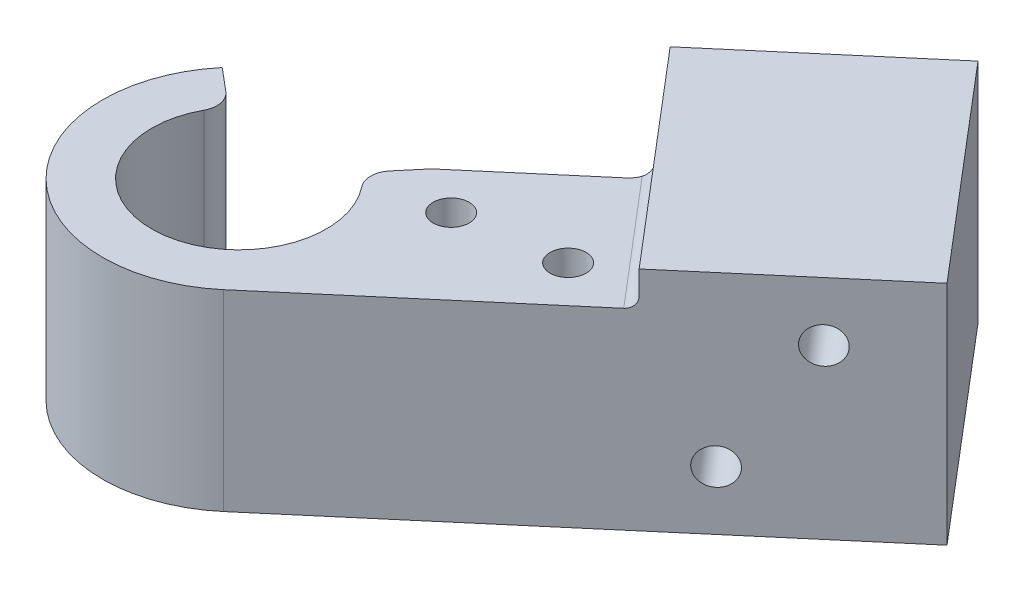
ISO-10303-21;
HEADER;
FILE_DESCRIPTION(('STEP AP214'),'2;1');
FILE_NAME('part.step','',(''),(''),'','','');
FILE_SCHEMA(('AUTOMOTIVE_DESIGN { 1 0 10303 214 1 1 1 1 }'));
ENDSEC;
DATA;
#1=APPLICATION_CONTEXT('core data for automotive mechanical design processes');
#2=APPLICATION_PROTOCOL_DEFINITION('international standard','automotive_design',2000,#1);
#3=PRODUCT_CONTEXT('',#1,'mechanical');
#4=PRODUCT('Part','Part','',(#3));
#5=PRODUCT_RELATED_PRODUCT_CATEGORY('part','',(#4));
#6=PRODUCT_DEFINITION_FORMATION('','',#4);
#7=PRODUCT_DEFINITION_CONTEXT('part definition',#1,'design');
#8=PRODUCT_DEFINITION('design','',#6,#7);
#9=PRODUCT_DEFINITION_SHAPE('','',#8);
#10=(LENGTH_UNIT() NAMED_UNIT(*) SI_UNIT(.MILLI.,.METRE.));
#11=(NAMED_UNIT(*) PLANE_ANGLE_UNIT() SI_UNIT($,.RADIAN.));
#12=(NAMED_UNIT(*) SI_UNIT($,.STERADIAN.) SOLID_ANGLE_UNIT());
#13=UNCERTAINTY_MEASURE_WITH_UNIT(LENGTH_MEASURE(1.E-05),#10,'distance_accuracy_value','');
#14=(GEOMETRIC_REPRESENTATION_CONTEXT(3) GLOBAL_UNCERTAINTY_ASSIGNED_CONTEXT((#13)) GLOBAL_UNIT_ASSIGNED_CONTEXT((#10,
#11,#12)) REPRESENTATION_CONTEXT('',''));
#15=CARTESIAN_POINT('',(0.,0.,0.));
#16=DIRECTION('',(0.,0.,1.));
#17=DIRECTION('',(1.,0.,0.));
#18=AXIS2_PLACEMENT_3D('',#15,#16,#17);
#19=CARTESIAN_POINT('',(0.,17.6,0.));
#20=DIRECTION('',(0.,-1.,0.));
#21=DIRECTION('',(0.,0.,-1.));
#22=AXIS2_PLACEMENT_3D('',#19,#20,#21);
#23=CYLINDRICAL_SURFACE('',#22,12.5);
#24=DIRECTION('',(0.,1.,0.));
#25=VECTOR('',#24,1.);
#26=CARTESIAN_POINT('',(8.10037181798933,0.,9.52018783482365));
#27=LINE('',#26,#25);
#28=CARTESIAN_POINT('',(8.10037181798933,0.,9.52018783482365));
#29=VERTEX_POINT('',#28);
#30=CARTESIAN_POINT('',(8.10037181798933,17.6,9.52018783482365));
#31=VERTEX_POINT('',#30);
#32=EDGE_CURVE('E298',#29,#31,#27,.T.);
#33=ORIENTED_EDGE('',*,*,#32,.T.);
#34=CARTESIAN_POINT('',(0.,17.6,0.));
#35=DIRECTION('',(0.,1.,0.));
#36=DIRECTION('',(0.,0.,1.));
#37=AXIS2_PLACEMENT_3D('',#34,#35,#36);
#38=CIRCLE('',#37,12.5);
#39=CARTESIAN_POINT('',(-9.57555553898724,17.6,-8.03484512108172));
#40=VERTEX_POINT('',#39);
#41=EDGE_CURVE('E341',#40,#31,#38,.T.);
#42=ORIENTED_EDGE('',*,*,#41,.F.);
#43=DIRECTION('',(0.,1.,0.));
#44=VECTOR('',#43,1.);
#45=CARTESIAN_POINT('',(-9.57555553898724,0.,-8.03484512108172));
#46=LINE('',#45,#44);
#47=CARTESIAN_POINT('',(-9.57555553898724,0.,-8.03484512108172));
#48=VERTEX_POINT('',#47);
#49=EDGE_CURVE('E324',#48,#40,#46,.T.);
#50=ORIENTED_EDGE('',*,*,#49,.F.);
#51=CARTESIAN_POINT('',(0.,0.,0.));
#52=DIRECTION('',(0.,1.,0.));
#53=DIRECTION('',(0.,0.,1.));
#54=AXIS2_PLACEMENT_3D('',#51,#52,#53);
#55=CIRCLE('',#54,12.5);
#56=EDGE_CURVE('E346',#48,#29,#55,.T.);
#57=ORIENTED_EDGE('',*,*,#56,.T.);
#58=EDGE_LOOP('',(#33,#42,#50,#57));
#59=FACE_BOUND('',#58,.T.);
#60=ADVANCED_FACE('F49',(#59),#23,.T.);
#61=CARTESIAN_POINT('',(0.,17.6,0.));
#62=DIRECTION('',(0.,1.,0.));
#63=DIRECTION('',(0.,0.,1.));
#64=AXIS2_PLACEMENT_3D('',#61,#62,#63);
#65=PLANE('',#64);
#66=CARTESIAN_POINT('',(21.7498736910186,17.6,-8.3869134163618));
#67=DIRECTION('',(0.,1.,0.));
#68=DIRECTION('',(0.,0.,1.));
#69=AXIS2_PLACEMENT_3D('',#66,#67,#68);
#70=CIRCLE('',#69,1.64999999999999);
#71=CARTESIAN_POINT('',(21.7498736910186,17.6,-6.73691341636181));
#72=VERTEX_POINT('',#71);
#73=EDGE_CURVE('E205',#72,#72,#70,.T.);
#74=ORIENTED_EDGE('',*,*,#73,.F.);
#75=EDGE_LOOP('',(#74));
#76=FACE_BOUND('',#75,.T.);
#77=CARTESIAN_POINT('',(12.4168047495357,17.6,-7.01075058677808));
#78=DIRECTION('',(0.,1.,0.));
#79=DIRECTION('',(0.,0.,1.));
#80=AXIS2_PLACEMENT_3D('',#77,#78,#79);
#81=CIRCLE('',#80,1.64999999999999);
#82=CARTESIAN_POINT('',(12.4168047495357,17.6,-5.36075058677809));
#83=VERTEX_POINT('',#82);
#84=EDGE_CURVE('E204',#83,#83,#81,.T.);
#85=ORIENTED_EDGE('',*,*,#84,.F.);
#86=EDGE_LOOP('',(#85));
#87=FACE_BOUND('',#86,.T.);
#88=DIRECTION('',(0.761615026785892,0.,-0.648029745439146));
#89=VECTOR('',#88,1.);
#90=CARTESIAN_POINT('',(8.10037181798933,17.6,9.52018783482365));
#91=LINE('',#90,#89);
#92=CARTESIAN_POINT('',(27.9023625144225,17.6,-7.32858554659416));
#93=VERTEX_POINT('',#92);
#94=EDGE_CURVE('E290',#31,#93,#91,.T.);
#95=ORIENTED_EDGE('',*,*,#94,.T.);
#96=DIRECTION('',(-0.648029745439146,0.,-0.761615026785892));
#97=VECTOR('',#96,1.);
#98=CARTESIAN_POINT('',(18.4501563547061,17.6,-18.4375543835721));
#99=LINE('',#98,#97);
#100=CARTESIAN_POINT('',(18.2765173077443,17.6,-18.6416285149428));
#101=VERTEX_POINT('',#100);
#102=EDGE_CURVE('E66',#93,#101,#99,.T.);
#103=ORIENTED_EDGE('',*,*,#102,.T.);
#104=CARTESIAN_POINT('',(16.3924818370419,17.6,-19.3127546917047));
#105=DIRECTION('',(0.,1.,0.));
#106=DIRECTION('',(0.,0.,1.));
#107=AXIS2_PLACEMENT_3D('',#104,#105,#106);
#108=CIRCLE('',#107,2.);
#109=CARTESIAN_POINT('',(17.6885413279202,17.6,-17.7895246381329));
#110=VERTEX_POINT('',#109);
#111=EDGE_CURVE('E59',#101,#110,#108,.F.);
#112=ORIENTED_EDGE('',*,*,#111,.T.);
#113=DIRECTION('',(-0.761615026785892,0.,0.648029745439146));
#114=VECTOR('',#113,1.);
#115=CARTESIAN_POINT('',(-1.35183434172712,17.6,-1.58878100215428));
#116=LINE('',#115,#114);
#117=CARTESIAN_POINT('',(8.03484512108176,17.6,-9.57555553898721));
#118=VERTEX_POINT('',#117);
#119=EDGE_CURVE('E295',#110,#118,#116,.T.);
#120=ORIENTED_EDGE('',*,*,#119,.T.);
#121=DIRECTION('',(0.642787609686541,0.,-0.766044443118977));
#122=VECTOR('',#121,1.);
#123=CARTESIAN_POINT('',(0.,17.6,0.));
#124=LINE('',#123,#122);
#125=CARTESIAN_POINT('',(6.29800662686119,17.6,-7.50567202374394));
#126=VERTEX_POINT('',#125);
#127=EDGE_CURVE('E310',#126,#118,#124,.T.);
#128=ORIENTED_EDGE('',*,*,#127,.F.);
#129=CARTESIAN_POINT('',(7.83009551309915,17.6,-6.22009680437086));
#130=DIRECTION('',(0.,1.,0.));
#131=DIRECTION('',(0.,0.,1.));
#132=AXIS2_PLACEMENT_3D('',#129,#130,#131);
#133=CIRCLE('',#132,2.);
#134=CARTESIAN_POINT('',(6.26407641047932,17.6,-4.97607744349669));
#135=VERTEX_POINT('',#134);
#136=EDGE_CURVE('E370',#126,#135,#133,.T.);
#137=ORIENTED_EDGE('',*,*,#136,.T.);
#138=CARTESIAN_POINT('',(0.,17.6,0.));
#139=DIRECTION('',(0.,1.,0.));
#140=DIRECTION('',(0.,0.,1.));
#141=AXIS2_PLACEMENT_3D('',#138,#139,#140);
#142=CIRCLE('',#141,8.);
#143=CARTESIAN_POINT('',(-7.03299779449363,17.6,-3.81273419249857));
#144=VERTEX_POINT('',#143);
#145=EDGE_CURVE('E328',#144,#135,#142,.T.);
#146=ORIENTED_EDGE('',*,*,#145,.F.);
#147=CARTESIAN_POINT('',(-8.79124724311704,17.6,-4.76591774062321));
#148=DIRECTION('',(0.,1.,0.));
#149=DIRECTION('',(0.,0.,1.));
#150=AXIS2_PLACEMENT_3D('',#147,#148,#149);
#151=CIRCLE('',#150,2.);
#152=CARTESIAN_POINT('',(-7.50567202374397,17.6,-6.29800662686116));
#153=VERTEX_POINT('',#152);
#154=EDGE_CURVE('E373',#144,#153,#151,.T.);
#155=ORIENTED_EDGE('',*,*,#154,.T.);
#156=DIRECTION('',(-0.766044443118979,0.,-0.642787609686538));
#157=VECTOR('',#156,1.);
#158=CARTESIAN_POINT('',(0.,17.6,0.));
#159=LINE('',#158,#157);
#160=EDGE_CURVE('E305',#153,#40,#159,.T.);
#161=ORIENTED_EDGE('',*,*,#160,.T.);
#162=ORIENTED_EDGE('',*,*,#41,.T.);
#163=EDGE_LOOP('',(#95,#103,#112,#120,#128,#137,#146,#155,#161,#162));
#164=FACE_BOUND('',#163,.T.);
#165=ADVANCED_FACE('F456',(#76,#87,#164),#65,.T.);
#166=CARTESIAN_POINT('',(0.,-22.6274169979695,0.));
#167=DIRECTION('',(0.,1.,0.));
#168=DIRECTION('',(0.,0.,1.));
#169=AXIS2_PLACEMENT_3D('',#166,#167,#168);
#170=CYLINDRICAL_SURFACE('',#169,8.);
#171=CARTESIAN_POINT('',(0.,2.,0.));
#172=DIRECTION('',(0.,1.,0.));
#173=DIRECTION('',(0.,0.,1.));
#174=AXIS2_PLACEMENT_3D('',#171,#172,#173);
#175=CIRCLE('',#174,8.);
#176=CARTESIAN_POINT('',(6.26407641047932,2.,-4.97607744349669));
#177=VERTEX_POINT('',#176);
#178=CARTESIAN_POINT('',(-7.03299779449363,2.,-3.81273419249857));
#179=VERTEX_POINT('',#178);
#180=EDGE_CURVE('E335',#177,#179,#175,.F.);
#181=ORIENTED_EDGE('',*,*,#180,.T.);
#182=DIRECTION('',(0.,1.,0.));
#183=VECTOR('',#182,1.);
#184=CARTESIAN_POINT('',(-7.03299779449363,-22.6274169979695,-3.81273419249856));
#185=LINE('',#184,#183);
#186=EDGE_CURVE('E367',#179,#144,#185,.T.);
#187=ORIENTED_EDGE('',*,*,#186,.T.);
#188=ORIENTED_EDGE('',*,*,#145,.T.);
#189=DIRECTION('',(0.,1.,0.));
#190=VECTOR('',#189,1.);
#191=CARTESIAN_POINT('',(6.26407641047932,-22.6274169979695,-4.97607744349669));
#192=LINE('',#191,#190);
#193=EDGE_CURVE('E363',#135,#177,#192,.F.);
#194=ORIENTED_EDGE('',*,*,#193,.T.);
#195=EDGE_LOOP('',(#181,#187,#188,#194));
#196=FACE_BOUND('',#195,.T.);
#197=ADVANCED_FACE('F462',(#196),#170,.F.);
#198=CARTESIAN_POINT('',(0.,-33.2,0.));
#199=DIRECTION('',(0.,1.,0.));
#200=DIRECTION('',(0.,0.,1.));
#201=AXIS2_PLACEMENT_3D('',#198,#199,#200);
#202=CYLINDRICAL_SURFACE('',#201,6.875);
#203=CARTESIAN_POINT('',(0.,0.,0.));
#204=DIRECTION('',(0.,1.,0.));
#205=DIRECTION('',(0.,0.,1.));
#206=AXIS2_PLACEMENT_3D('',#203,#204,#205);
#207=CIRCLE('',#206,6.875);
#208=CARTESIAN_POINT('',(0.,0.,6.875));
#209=VERTEX_POINT('',#208);
#210=EDGE_CURVE('E349',#209,#209,#207,.T.);
#211=ORIENTED_EDGE('',*,*,#210,.F.);
#212=EDGE_LOOP('',(#211));
#213=FACE_BOUND('',#212,.T.);
#214=CARTESIAN_POINT('',(0.,2.,0.));
#215=DIRECTION('',(0.,1.,0.));
#216=DIRECTION('',(0.,0.,1.));
#217=AXIS2_PLACEMENT_3D('',#214,#215,#216);
#218=CIRCLE('',#217,6.875);
#219=CARTESIAN_POINT('',(0.,2.,6.875));
#220=VERTEX_POINT('',#219);
#221=EDGE_CURVE('E340',#220,#220,#218,.F.);
#222=ORIENTED_EDGE('',*,*,#221,.F.);
#223=EDGE_LOOP('',(#222));
#224=FACE_BOUND('',#223,.T.);
#225=ADVANCED_FACE('F636',(#213,#224),#202,.F.);
#226=CARTESIAN_POINT('',(0.,0.,0.));
#227=DIRECTION('',(0.,1.,0.));
#228=DIRECTION('',(0.,0.,1.));
#229=AXIS2_PLACEMENT_3D('',#226,#227,#228);
#230=PLANE('',#229);
#231=DIRECTION('',(-0.766044443118979,0.,-0.642787609686538));
#232=VECTOR('',#231,1.);
#233=CARTESIAN_POINT('',(0.,0.,0.));
#234=LINE('',#233,#232);
#235=CARTESIAN_POINT('',(-6.85170979440004,0.,-5.7492671614148));
#236=VERTEX_POINT('',#235);
#237=EDGE_CURVE('E306',#236,#48,#234,.T.);
#238=ORIENTED_EDGE('',*,*,#237,.F.);
#239=CARTESIAN_POINT('',(-6.2089221847135,0.,-6.51531160453378));
#240=DIRECTION('',(0.,1.,0.));
#241=DIRECTION('',(0.,0.,1.));
#242=AXIS2_PLACEMENT_3D('',#239,#240,#241);
#243=CIRCLE('',#242,1.);
#244=CARTESIAN_POINT('',(-5.51904194196755,0.,-5.79138809291892));
#245=VERTEX_POINT('',#244);
#246=EDGE_CURVE('E414',#236,#245,#243,.T.);
#247=ORIENTED_EDGE('',*,*,#246,.T.);
#248=CARTESIAN_POINT('',(0.,0.,0.));
#249=DIRECTION('',(0.,1.,0.));
#250=DIRECTION('',(0.,0.,1.));
#251=AXIS2_PLACEMENT_3D('',#248,#249,#250);
#252=CIRCLE('',#251,8.);
#253=CARTESIAN_POINT('',(4.42953130515187,0.,-6.66177547029916));
#254=VERTEX_POINT('',#253);
#255=EDGE_CURVE('E309',#245,#254,#252,.F.);
#256=ORIENTED_EDGE('',*,*,#255,.T.);
#257=CARTESIAN_POINT('',(4.98322271829585,0.,-7.49449740408656));
#258=DIRECTION('',(0.,1.,0.));
#259=DIRECTION('',(0.,0.,1.));
#260=AXIS2_PLACEMENT_3D('',#257,#258,#259);
#261=CIRCLE('',#260,1.);
#262=CARTESIAN_POINT('',(5.74926716141483,0.,-6.85170979440002));
#263=VERTEX_POINT('',#262);
#264=EDGE_CURVE('E420',#254,#263,#261,.T.);
#265=ORIENTED_EDGE('',*,*,#264,.T.);
#266=DIRECTION('',(0.642787609686541,0.,-0.766044443118977));
#267=VECTOR('',#266,1.);
#268=CARTESIAN_POINT('',(0.,0.,0.));
#269=LINE('',#268,#267);
#270=CARTESIAN_POINT('',(8.03484512108176,0.,-9.57555553898721));
#271=VERTEX_POINT('',#270);
#272=EDGE_CURVE('E314',#263,#271,#269,.T.);
#273=ORIENTED_EDGE('',*,*,#272,.T.);
#274=DIRECTION('',(-0.761615026785892,0.,0.648029745439146));
#275=VECTOR('',#274,1.);
#276=CARTESIAN_POINT('',(-1.35183434172712,0.,-1.58878100215428));
#277=LINE('',#276,#275);
#278=CARTESIAN_POINT('',(17.6885413279202,0.,-17.7895246381329));
#279=VERTEX_POINT('',#278);
#280=EDGE_CURVE('E294',#279,#271,#277,.T.);
#281=ORIENTED_EDGE('',*,*,#280,.F.);
#282=CARTESIAN_POINT('',(16.3924818370419,0.,-19.3127546917047));
#283=DIRECTION('',(0.,1.,0.));
#284=DIRECTION('',(0.,0.,1.));
#285=AXIS2_PLACEMENT_3D('',#282,#283,#284);
#286=CIRCLE('',#285,2.);
#287=CARTESIAN_POINT('',(17.9157118906137,0.,-20.608814182583));
#288=VERTEX_POINT('',#287);
#289=EDGE_CURVE('E12',#279,#288,#286,.T.);
#290=ORIENTED_EDGE('',*,*,#289,.T.);
#291=DIRECTION('',(-0.648029745439146,0.,-0.761615026785892));
#292=VECTOR('',#291,1.);
#293=CARTESIAN_POINT('',(28.6639775412084,0.,-7.9766152920333));
#294=LINE('',#293,#292);
#295=CARTESIAN_POINT('',(12.4632339052298,0.,-27.0169909616806));
#296=VERTEX_POINT('',#295);
#297=EDGE_CURVE('E271',#288,#296,#294,.T.);
#298=ORIENTED_EDGE('',*,*,#297,.T.);
#299=DIRECTION('',(-0.761615026785892,0.,0.648029745439146));
#300=VECTOR('',#299,1.);
#301=CARTESIAN_POINT('',(27.6955344409476,0.,-39.9775858704635));
#302=LINE('',#301,#300);
#303=CARTESIAN_POINT('',(27.6955344409476,0.,-39.9775858704635));
#304=VERTEX_POINT('',#303);
#305=EDGE_CURVE('E286',#304,#296,#302,.T.);
#306=ORIENTED_EDGE('',*,*,#305,.F.);
#307=DIRECTION('',(-0.648029745439146,0.,-0.761615026785892));
#308=VECTOR('',#307,1.);
#309=CARTESIAN_POINT('',(43.8962780769263,0.,-20.9372102008162));
#310=LINE('',#309,#308);
#311=CARTESIAN_POINT('',(43.8962780769263,0.,-20.9372102008162));
#312=VERTEX_POINT('',#311);
#313=EDGE_CURVE('E257',#312,#304,#310,.T.);
#314=ORIENTED_EDGE('',*,*,#313,.F.);
#315=DIRECTION('',(0.761615026785892,0.,-0.648029745439146));
#316=VECTOR('',#315,1.);
#317=CARTESIAN_POINT('',(8.10037181798933,0.,9.52018783482365));
#318=LINE('',#317,#316);
#319=EDGE_CURVE('E291',#29,#312,#318,.T.);
#320=ORIENTED_EDGE('',*,*,#319,.F.);
#321=ORIENTED_EDGE('',*,*,#56,.F.);
#322=EDGE_LOOP('',(#238,#247,#256,#265,#273,#281,#290,#298,#306,#314,#320,#321));
#323=FACE_BOUND('',#322,.T.);
#324=ORIENTED_EDGE('',*,*,#210,.T.);
#325=EDGE_LOOP('',(#324));
#326=FACE_BOUND('',#325,.T.);
#327=ADVANCED_FACE('F466',(#323,#326),#230,.F.);
#328=CARTESIAN_POINT('',(0.,2.,0.));
#329=DIRECTION('',(0.,1.,0.));
#330=DIRECTION('',(0.,0.,1.));
#331=AXIS2_PLACEMENT_3D('',#328,#329,#330);
#332=PLANE('',#331);
#333=CARTESIAN_POINT('',(-5.51904194196755,2.,-5.79138809291892));
#334=VERTEX_POINT('',#333);
#335=CARTESIAN_POINT('',(4.42953130515187,2.,-6.66177547029916));
#336=VERTEX_POINT('',#335);
#337=EDGE_CURVE('E336',#334,#336,#175,.F.);
#338=ORIENTED_EDGE('',*,*,#337,.F.);
#339=CARTESIAN_POINT('',(-6.2089221847135,2.,-6.51531160453378));
#340=DIRECTION('',(0.,1.,0.));
#341=DIRECTION('',(0.,0.,1.));
#342=AXIS2_PLACEMENT_3D('',#339,#340,#341);
#343=CIRCLE('',#342,1.);
#344=CARTESIAN_POINT('',(-6.85170979440004,2.,-5.7492671614148));
#345=VERTEX_POINT('',#344);
#346=EDGE_CURVE('E411',#334,#345,#343,.F.);
#347=ORIENTED_EDGE('',*,*,#346,.T.);
#348=DIRECTION('',(0.766044443118979,0.,0.642787609686538));
#349=VECTOR('',#348,1.);
#350=CARTESIAN_POINT('',(0.,2.,0.));
#351=LINE('',#350,#349);
#352=CARTESIAN_POINT('',(-7.50567202374396,2.,-6.29800662686116));
#353=VERTEX_POINT('',#352);
#354=EDGE_CURVE('E345',#353,#345,#351,.T.);
#355=ORIENTED_EDGE('',*,*,#354,.F.);
#356=CARTESIAN_POINT('',(-8.79124724311704,2.,-4.76591774062321));
#357=DIRECTION('',(0.,1.,0.));
#358=DIRECTION('',(0.,0.,1.));
#359=AXIS2_PLACEMENT_3D('',#356,#357,#358);
#360=CIRCLE('',#359,2.);
#361=EDGE_CURVE('E382',#353,#179,#360,.F.);
#362=ORIENTED_EDGE('',*,*,#361,.T.);
#363=ORIENTED_EDGE('',*,*,#180,.F.);
#364=CARTESIAN_POINT('',(7.83009551309915,2.,-6.22009680437086));
#365=DIRECTION('',(0.,1.,0.));
#366=DIRECTION('',(0.,0.,1.));
#367=AXIS2_PLACEMENT_3D('',#364,#365,#366);
#368=CIRCLE('',#367,2.);
#369=CARTESIAN_POINT('',(6.29800662686119,2.,-7.50567202374394));
#370=VERTEX_POINT('',#369);
#371=EDGE_CURVE('E385',#177,#370,#368,.F.);
#372=ORIENTED_EDGE('',*,*,#371,.T.);
#373=DIRECTION('',(0.642787609686541,0.,-0.766044443118977));
#374=VECTOR('',#373,1.);
#375=CARTESIAN_POINT('',(0.,2.,0.));
#376=LINE('',#375,#374);
#377=CARTESIAN_POINT('',(5.74926716141483,2.,-6.85170979440002));
#378=VERTEX_POINT('',#377);
#379=EDGE_CURVE('E379',#378,#370,#376,.T.);
#380=ORIENTED_EDGE('',*,*,#379,.F.);
#381=CARTESIAN_POINT('',(4.98322271829585,2.,-7.49449740408656));
#382=DIRECTION('',(0.,1.,0.));
#383=DIRECTION('',(0.,0.,1.));
#384=AXIS2_PLACEMENT_3D('',#381,#382,#383);
#385=CIRCLE('',#384,1.);
#386=EDGE_CURVE('E417',#378,#336,#385,.F.);
#387=ORIENTED_EDGE('',*,*,#386,.T.);
#388=EDGE_LOOP('',(#338,#347,#355,#362,#363,#372,#380,#387));
#389=FACE_BOUND('',#388,.T.);
#390=ORIENTED_EDGE('',*,*,#221,.T.);
#391=EDGE_LOOP('',(#390));
#392=FACE_BOUND('',#391,.T.);
#393=ADVANCED_FACE('F574',(#389,#392),#332,.T.);
#394=CARTESIAN_POINT('',(0.,0.,0.));
#395=DIRECTION('',(0.642787609686538,0.,-0.766044443118979));
#396=DIRECTION('',(-0.766044443118979,0.,-0.642787609686538));
#397=AXIS2_PLACEMENT_3D('',#394,#395,#396);
#398=PLANE('',#397);
#399=ORIENTED_EDGE('',*,*,#354,.T.);
#400=DIRECTION('',(0.,1.,0.));
#401=VECTOR('',#400,1.);
#402=CARTESIAN_POINT('',(-6.85170979440004,0.,-5.7492671614148));
#403=LINE('',#402,#401);
#404=EDGE_CURVE('E404',#345,#236,#403,.F.);
#405=ORIENTED_EDGE('',*,*,#404,.T.);
#406=ORIENTED_EDGE('',*,*,#237,.T.);
#407=ORIENTED_EDGE('',*,*,#49,.T.);
#408=ORIENTED_EDGE('',*,*,#160,.F.);
#409=DIRECTION('',(0.,-1.,0.));
#410=VECTOR('',#409,1.);
#411=CARTESIAN_POINT('',(-7.50567202374396,1.99999999999999,-6.29800662686116));
#412=LINE('',#411,#410);
#413=EDGE_CURVE('E359',#153,#353,#412,.T.);
#414=ORIENTED_EDGE('',*,*,#413,.T.);
#415=EDGE_LOOP('',(#399,#405,#406,#407,#408,#414));
#416=FACE_BOUND('',#415,.T.);
#417=ADVANCED_FACE('F485',(#416),#398,.T.);
#418=CARTESIAN_POINT('',(0.,0.,0.));
#419=DIRECTION('',(0.766044443118977,0.,0.642787609686541));
#420=DIRECTION('',(0.642787609686541,0.,-0.766044443118977));
#421=AXIS2_PLACEMENT_3D('',#418,#419,#420);
#422=PLANE('',#421);
#423=ORIENTED_EDGE('',*,*,#272,.F.);
#424=DIRECTION('',(0.,-1.,0.));
#425=VECTOR('',#424,1.);
#426=CARTESIAN_POINT('',(5.74926716141483,2.,-6.85170979440002));
#427=LINE('',#426,#425);
#428=EDGE_CURVE('E407',#263,#378,#427,.F.);
#429=ORIENTED_EDGE('',*,*,#428,.T.);
#430=ORIENTED_EDGE('',*,*,#379,.T.);
#431=DIRECTION('',(0.,1.,0.));
#432=VECTOR('',#431,1.);
#433=CARTESIAN_POINT('',(6.29800662686119,0.,-7.50567202374394));
#434=LINE('',#433,#432);
#435=EDGE_CURVE('E376',#370,#126,#434,.T.);
#436=ORIENTED_EDGE('',*,*,#435,.T.);
#437=ORIENTED_EDGE('',*,*,#127,.T.);
#438=DIRECTION('',(0.,1.,0.));
#439=VECTOR('',#438,1.);
#440=CARTESIAN_POINT('',(8.03484512108176,0.,-9.57555553898721));
#441=LINE('',#440,#439);
#442=EDGE_CURVE('E318',#271,#118,#441,.T.);
#443=ORIENTED_EDGE('',*,*,#442,.F.);
#444=EDGE_LOOP('',(#423,#429,#430,#436,#437,#443));
#445=FACE_BOUND('',#444,.T.);
#446=ADVANCED_FACE('F592',(#445),#422,.F.);
#447=CARTESIAN_POINT('',(0.,0.,0.));
#448=DIRECTION('',(0.,1.,0.));
#449=DIRECTION('',(0.,0.,1.));
#450=AXIS2_PLACEMENT_3D('',#447,#448,#449);
#451=CYLINDRICAL_SURFACE('',#450,8.);
#452=ORIENTED_EDGE('',*,*,#255,.F.);
#453=DIRECTION('',(0.,1.,0.));
#454=VECTOR('',#453,1.);
#455=CARTESIAN_POINT('',(-5.51904194196755,0.,-5.79138809291892));
#456=LINE('',#455,#454);
#457=EDGE_CURVE('E400',#245,#334,#456,.T.);
#458=ORIENTED_EDGE('',*,*,#457,.T.);
#459=ORIENTED_EDGE('',*,*,#337,.T.);
#460=DIRECTION('',(0.,1.,0.));
#461=VECTOR('',#460,1.);
#462=CARTESIAN_POINT('',(4.42953130515187,0.,-6.66177547029916));
#463=LINE('',#462,#461);
#464=EDGE_CURVE('E397',#336,#254,#463,.F.);
#465=ORIENTED_EDGE('',*,*,#464,.T.);
#466=EDGE_LOOP('',(#452,#458,#459,#465));
#467=FACE_BOUND('',#466,.T.);
#468=ADVANCED_FACE('F586',(#467),#451,.T.);
#469=CARTESIAN_POINT('',(8.10037181798933,0.,9.52018783482365));
#470=DIRECTION('',(0.648029745439146,0.,0.761615026785892));
#471=DIRECTION('',(0.761615026785892,0.,-0.648029745439146));
#472=AXIS2_PLACEMENT_3D('',#469,#470,#471);
#473=PLANE('',#472);
#474=CARTESIAN_POINT('',(37.8033578626391,15.3875,-15.7529722373031));
#475=DIRECTION('',(0.648029745439147,0.,0.761615026785892));
#476=DIRECTION('',(0.761615026785892,0.,-0.648029745439147));
#477=AXIS2_PLACEMENT_3D('',#474,#475,#476);
#478=CIRCLE('',#477,1.64999999999999);
#479=CARTESIAN_POINT('',(39.0600226568358,15.3875,-16.8222213172777));
#480=VERTEX_POINT('',#479);
#481=EDGE_CURVE('E220',#480,#480,#478,.T.);
#482=ORIENTED_EDGE('',*,*,#481,.F.);
#483=EDGE_LOOP('',(#482));
#484=FACE_BOUND('',#483,.T.);
#485=CARTESIAN_POINT('',(32.4720526751379,5.3875,-11.216764019229));
#486=DIRECTION('',(0.648029745439147,0.,0.761615026785892));
#487=DIRECTION('',(0.761615026785892,0.,-0.648029745439147));
#488=AXIS2_PLACEMENT_3D('',#485,#486,#487);
#489=CIRCLE('',#488,1.64999999999999);
#490=CARTESIAN_POINT('',(33.7287174693346,5.3875,-12.2860130992036));
#491=VERTEX_POINT('',#490);
#492=EDGE_CURVE('E228',#491,#491,#489,.T.);
#493=ORIENTED_EDGE('',*,*,#492,.F.);
#494=EDGE_LOOP('',(#493));
#495=FACE_BOUND('',#494,.T.);
#496=ORIENTED_EDGE('',*,*,#94,.F.);
#497=ORIENTED_EDGE('',*,*,#32,.F.);
#498=ORIENTED_EDGE('',*,*,#319,.T.);
#499=DIRECTION('',(0.,-1.,0.));
#500=VECTOR('',#499,1.);
#501=CARTESIAN_POINT('',(43.8962780769263,0.,-20.9372102008162));
#502=LINE('',#501,#500);
#503=CARTESIAN_POINT('',(43.8962780769263,20.775,-20.9372102008162));
#504=VERTEX_POINT('',#503);
#505=EDGE_CURVE('E253',#504,#312,#502,.T.);
#506=ORIENTED_EDGE('',*,*,#505,.F.);
#507=DIRECTION('',(-0.761615026785892,0.,0.648029745439146));
#508=VECTOR('',#507,1.);
#509=CARTESIAN_POINT('',(43.8962780769263,20.775,-20.9372102008162));
#510=LINE('',#509,#508);
#511=CARTESIAN_POINT('',(28.6639775412084,20.775,-7.9766152920333));
#512=VERTEX_POINT('',#511);
#513=EDGE_CURVE('E267',#504,#512,#510,.T.);
#514=ORIENTED_EDGE('',*,*,#513,.T.);
#515=DIRECTION('',(0.,-1.,0.));
#516=VECTOR('',#515,1.);
#517=CARTESIAN_POINT('',(28.6639775412084,0.,-7.9766152920333));
#518=LINE('',#517,#516);
#519=CARTESIAN_POINT('',(28.6639775412084,18.6,-7.9766152920333));
#520=VERTEX_POINT('',#519);
#521=EDGE_CURVE('E252',#512,#520,#518,.T.);
#522=ORIENTED_EDGE('',*,*,#521,.T.);
#523=CARTESIAN_POINT('',(27.9023625144225,18.6,-7.32858554659416));
#524=DIRECTION('',(0.648029745439146,0.,0.761615026785892));
#525=DIRECTION('',(0.761615026785892,0.,-0.648029745439146));
#526=AXIS2_PLACEMENT_3D('',#523,#524,#525);
#527=CIRCLE('',#526,1.);
#528=EDGE_CURVE('E394',#520,#93,#527,.F.);
#529=ORIENTED_EDGE('',*,*,#528,.T.);
#530=EDGE_LOOP('',(#496,#497,#498,#506,#514,#522,#529));
#531=FACE_BOUND('',#530,.T.);
#532=ADVANCED_FACE('F477',(#484,#495,#531),#473,.T.);
#533=CARTESIAN_POINT('',(-1.35183434172712,0.,-1.58878100215428));
#534=DIRECTION('',(-0.648029745439146,0.,-0.761615026785892));
#535=DIRECTION('',(-0.761615026785892,0.,0.648029745439146));
#536=AXIS2_PLACEMENT_3D('',#533,#534,#535);
#537=PLANE('',#536);
#538=ORIENTED_EDGE('',*,*,#119,.F.);
#539=DIRECTION('',(0.,1.,0.));
#540=VECTOR('',#539,1.);
#541=CARTESIAN_POINT('',(17.6885413279202,0.,-17.7895246381329));
#542=LINE('',#541,#540);
#543=EDGE_CURVE('E74',#110,#279,#542,.F.);
#544=ORIENTED_EDGE('',*,*,#543,.T.);
#545=ORIENTED_EDGE('',*,*,#280,.T.);
#546=ORIENTED_EDGE('',*,*,#442,.T.);
#547=EDGE_LOOP('',(#538,#544,#545,#546));
#548=FACE_BOUND('',#547,.T.);
#549=ADVANCED_FACE('F469',(#548),#537,.T.);
#550=CARTESIAN_POINT('',(-8.79124724311704,-22.6274169979695,-4.76591774062321));
#551=DIRECTION('',(0.,1.,0.));
#552=DIRECTION('',(0.,0.,1.));
#553=AXIS2_PLACEMENT_3D('',#550,#551,#552);
#554=CYLINDRICAL_SURFACE('',#553,2.);
#555=ORIENTED_EDGE('',*,*,#154,.F.);
#556=ORIENTED_EDGE('',*,*,#186,.F.);
#557=ORIENTED_EDGE('',*,*,#361,.F.);
#558=ORIENTED_EDGE('',*,*,#413,.F.);
#559=EDGE_LOOP('',(#555,#556,#557,#558));
#560=FACE_BOUND('',#559,.T.);
#561=ADVANCED_FACE('F467',(#560),#554,.T.);
#562=CARTESIAN_POINT('',(7.83009551309915,-22.6274169979695,-6.22009680437086));
#563=DIRECTION('',(0.,1.,0.));
#564=DIRECTION('',(0.,0.,1.));
#565=AXIS2_PLACEMENT_3D('',#562,#563,#564);
#566=CYLINDRICAL_SURFACE('',#565,2.);
#567=ORIENTED_EDGE('',*,*,#136,.F.);
#568=ORIENTED_EDGE('',*,*,#435,.F.);
#569=ORIENTED_EDGE('',*,*,#371,.F.);
#570=ORIENTED_EDGE('',*,*,#193,.F.);
#571=EDGE_LOOP('',(#567,#568,#569,#570));
#572=FACE_BOUND('',#571,.T.);
#573=ADVANCED_FACE('F443',(#572),#566,.T.);
#574=CARTESIAN_POINT('',(20.5636057232191,0.,-17.496803126857));
#575=DIRECTION('',(-0.761615026785892,0.,0.648029745439146));
#576=DIRECTION('',(0.648029745439146,0.,0.761615026785892));
#577=AXIS2_PLACEMENT_3D('',#574,#575,#576);
#578=PLANE('',#577);
#579=ORIENTED_EDGE('',*,*,#297,.F.);
#580=DIRECTION('',(0.,1.,0.));
#581=VECTOR('',#580,1.);
#582=CARTESIAN_POINT('',(17.9157118906137,18.6,-20.608814182583));
#583=LINE('',#582,#581);
#584=CARTESIAN_POINT('',(17.9157118906137,18.6,-20.608814182583));
#585=VERTEX_POINT('',#584);
#586=EDGE_CURVE('E423',#288,#585,#583,.T.);
#587=ORIENTED_EDGE('',*,*,#586,.T.);
#588=DIRECTION('',(-0.648029745439146,0.,-0.761615026785892));
#589=VECTOR('',#588,1.);
#590=CARTESIAN_POINT('',(28.6639775412084,18.6,-7.97661529203331));
#591=LINE('',#590,#589);
#592=EDGE_CURVE('E391',#585,#520,#591,.F.);
#593=ORIENTED_EDGE('',*,*,#592,.T.);
#594=ORIENTED_EDGE('',*,*,#521,.F.);
#595=DIRECTION('',(0.648029745439146,0.,0.761615026785892));
#596=VECTOR('',#595,1.);
#597=CARTESIAN_POINT('',(28.6639775412084,20.775,-7.9766152920333));
#598=LINE('',#597,#596);
#599=CARTESIAN_POINT('',(12.4632339052298,20.775,-27.0169909616806));
#600=VERTEX_POINT('',#599);
#601=EDGE_CURVE('E258',#600,#512,#598,.T.);
#602=ORIENTED_EDGE('',*,*,#601,.F.);
#603=DIRECTION('',(0.,1.,0.));
#604=VECTOR('',#603,1.);
#605=CARTESIAN_POINT('',(12.4632339052298,0.,-27.0169909616806));
#606=LINE('',#605,#604);
#607=EDGE_CURVE('E274',#296,#600,#606,.T.);
#608=ORIENTED_EDGE('',*,*,#607,.F.);
#609=EDGE_LOOP('',(#579,#587,#593,#594,#602,#608));
#610=FACE_BOUND('',#609,.T.);
#611=ADVANCED_FACE('F475',(#610),#578,.T.);
#612=CARTESIAN_POINT('',(27.6955344409476,0.,-39.9775858704635));
#613=DIRECTION('',(0.648029745439146,0.,0.761615026785892));
#614=DIRECTION('',(0.761615026785892,0.,-0.648029745439146));
#615=AXIS2_PLACEMENT_3D('',#612,#613,#614);
#616=PLANE('',#615);
#617=CARTESIAN_POINT('',(21.6026142266605,15.3875,-34.7933479069504));
#618=DIRECTION('',(-0.648029745439146,0.,-0.761615026785892));
#619=DIRECTION('',(-0.761615026785892,0.,0.648029745439146));
#620=AXIS2_PLACEMENT_3D('',#617,#618,#619);
#621=CIRCLE('',#620,1.64999999999999);
#622=CARTESIAN_POINT('',(20.3459494324637,15.3875,-33.7240988269758));
#623=VERTEX_POINT('',#622);
#624=EDGE_CURVE('E236',#623,#623,#621,.T.);
#625=ORIENTED_EDGE('',*,*,#624,.F.);
#626=EDGE_LOOP('',(#625));
#627=FACE_BOUND('',#626,.T.);
#628=CARTESIAN_POINT('',(16.2713090391592,5.3875,-30.2571396888763));
#629=DIRECTION('',(-0.648029745439146,0.,-0.761615026785892));
#630=DIRECTION('',(-0.761615026785892,0.,0.648029745439146));
#631=AXIS2_PLACEMENT_3D('',#628,#629,#630);
#632=CIRCLE('',#631,1.64999999999999);
#633=CARTESIAN_POINT('',(15.0146442449625,5.3875,-29.1878906089017));
#634=VERTEX_POINT('',#633);
#635=EDGE_CURVE('E244',#634,#634,#632,.T.);
#636=ORIENTED_EDGE('',*,*,#635,.F.);
#637=EDGE_LOOP('',(#636));
#638=FACE_BOUND('',#637,.T.);
#639=ORIENTED_EDGE('',*,*,#607,.T.);
#640=DIRECTION('',(-0.761615026785892,0.,0.648029745439146));
#641=VECTOR('',#640,1.);
#642=CARTESIAN_POINT('',(27.6955344409476,20.775,-39.9775858704635));
#643=LINE('',#642,#641);
#644=CARTESIAN_POINT('',(27.6955344409476,20.775,-39.9775858704635));
#645=VERTEX_POINT('',#644);
#646=EDGE_CURVE('E282',#645,#600,#643,.T.);
#647=ORIENTED_EDGE('',*,*,#646,.F.);
#648=DIRECTION('',(0.,1.,0.));
#649=VECTOR('',#648,1.);
#650=CARTESIAN_POINT('',(27.6955344409476,0.,-39.9775858704635));
#651=LINE('',#650,#649);
#652=EDGE_CURVE('E261',#304,#645,#651,.T.);
#653=ORIENTED_EDGE('',*,*,#652,.F.);
#654=ORIENTED_EDGE('',*,*,#305,.T.);
#655=EDGE_LOOP('',(#639,#647,#653,#654));
#656=FACE_BOUND('',#655,.T.);
#657=ADVANCED_FACE('F602',(#627,#638,#656),#616,.F.);
#658=CARTESIAN_POINT('',(43.8962780769263,20.775,-20.9372102008162));
#659=DIRECTION('',(0.,-1.,0.));
#660=DIRECTION('',(0.,0.,-1.));
#661=AXIS2_PLACEMENT_3D('',#658,#659,#660);
#662=PLANE('',#661);
#663=ORIENTED_EDGE('',*,*,#601,.T.);
#664=ORIENTED_EDGE('',*,*,#513,.F.);
#665=DIRECTION('',(0.648029745439146,0.,0.761615026785892));
#666=VECTOR('',#665,1.);
#667=CARTESIAN_POINT('',(43.8962780769263,20.775,-20.9372102008162));
#668=LINE('',#667,#666);
#669=EDGE_CURVE('E264',#645,#504,#668,.T.);
#670=ORIENTED_EDGE('',*,*,#669,.F.);
#671=ORIENTED_EDGE('',*,*,#646,.T.);
#672=EDGE_LOOP('',(#663,#664,#670,#671));
#673=FACE_BOUND('',#672,.T.);
#674=ADVANCED_FACE('F610',(#673),#662,.F.);
#675=CARTESIAN_POINT('',(35.7959062589369,0.,-30.4573980356399));
#676=DIRECTION('',(-0.761615026785892,0.,0.648029745439146));
#677=DIRECTION('',(0.648029745439146,0.,0.761615026785892));
#678=AXIS2_PLACEMENT_3D('',#675,#676,#677);
#679=PLANE('',#678);
#680=ORIENTED_EDGE('',*,*,#505,.T.);
#681=ORIENTED_EDGE('',*,*,#313,.T.);
#682=ORIENTED_EDGE('',*,*,#652,.T.);
#683=ORIENTED_EDGE('',*,*,#669,.T.);
#684=EDGE_LOOP('',(#680,#681,#682,#683));
#685=FACE_BOUND('',#684,.T.);
#686=ADVANCED_FACE('F606',(#685),#679,.F.);
#687=CARTESIAN_POINT('',(20.8075172572332,5.3875,-24.9258345013751));
#688=DIRECTION('',(-0.648029745439146,0.,-0.761615026785892));
#689=DIRECTION('',(-0.761615026785892,0.,0.648029745439146));
#690=AXIS2_PLACEMENT_3D('',#687,#688,#689);
#691=CONICAL_SURFACE('',#690,1.65,1.02974425867665);
#692=CARTESIAN_POINT('',(21.4499869213214,5.3875,-24.1707541152239));
#693=VERTEX_POINT('',#692);
#694=VERTEX_LOOP('',#693);
#695=FACE_BOUND('',#694,.T.);
#696=CARTESIAN_POINT('',(20.8075172572332,5.3875,-24.9258345013751));
#697=DIRECTION('',(-0.648029745439146,0.,-0.761615026785892));
#698=DIRECTION('',(-0.761615026785892,0.,0.648029745439146));
#699=AXIS2_PLACEMENT_3D('',#696,#697,#698);
#700=CIRCLE('',#699,1.65);
#701=CARTESIAN_POINT('',(19.5508524630365,5.3875,-23.8565854214005));
#702=VERTEX_POINT('',#701);
#703=EDGE_CURVE('E248',#702,#702,#700,.T.);
#704=ORIENTED_EDGE('',*,*,#703,.T.);
#705=EDGE_LOOP('',(#704));
#706=FACE_BOUND('',#705,.T.);
#707=ADVANCED_FACE('F617',(#695,#706),#691,.F.);
#708=CARTESIAN_POINT('',(16.2713090391592,5.3875,-30.2571396888763));
#709=DIRECTION('',(-0.648029745439146,0.,-0.761615026785892));
#710=DIRECTION('',(-0.761615026785892,0.,0.648029745439146));
#711=AXIS2_PLACEMENT_3D('',#708,#709,#710);
#712=CYLINDRICAL_SURFACE('',#711,1.64999999999999);
#713=ORIENTED_EDGE('',*,*,#703,.F.);
#714=EDGE_LOOP('',(#713));
#715=FACE_BOUND('',#714,.T.);
#716=ORIENTED_EDGE('',*,*,#635,.T.);
#717=EDGE_LOOP('',(#716));
#718=FACE_BOUND('',#717,.T.);
#719=ADVANCED_FACE('F701',(#715,#718),#712,.F.);
#720=CARTESIAN_POINT('',(26.1388224447345,15.3875,-29.4620427194491));
#721=DIRECTION('',(-0.648029745439146,0.,-0.761615026785892));
#722=DIRECTION('',(-0.761615026785892,0.,0.648029745439146));
#723=AXIS2_PLACEMENT_3D('',#720,#721,#722);
#724=CONICAL_SURFACE('',#723,1.65,1.02974425867665);
#725=CARTESIAN_POINT('',(26.7812921088227,15.3875,-28.7069623332979));
#726=VERTEX_POINT('',#725);
#727=VERTEX_LOOP('',#726);
#728=FACE_BOUND('',#727,.T.);
#729=CARTESIAN_POINT('',(26.1388224447345,15.3875,-29.4620427194491));
#730=DIRECTION('',(-0.648029745439146,0.,-0.761615026785892));
#731=DIRECTION('',(-0.761615026785892,0.,0.648029745439146));
#732=AXIS2_PLACEMENT_3D('',#729,#730,#731);
#733=CIRCLE('',#732,1.65);
#734=CARTESIAN_POINT('',(24.8821576505378,15.3875,-28.3927936394745));
#735=VERTEX_POINT('',#734);
#736=EDGE_CURVE('E240',#735,#735,#733,.T.);
#737=ORIENTED_EDGE('',*,*,#736,.T.);
#738=EDGE_LOOP('',(#737));
#739=FACE_BOUND('',#738,.T.);
#740=ADVANCED_FACE('F710',(#728,#739),#724,.F.);
#741=CARTESIAN_POINT('',(21.6026142266605,15.3875,-34.7933479069504));
#742=DIRECTION('',(-0.648029745439146,0.,-0.761615026785892));
#743=DIRECTION('',(-0.761615026785892,0.,0.648029745439146));
#744=AXIS2_PLACEMENT_3D('',#741,#742,#743);
#745=CYLINDRICAL_SURFACE('',#744,1.64999999999999);
#746=ORIENTED_EDGE('',*,*,#736,.F.);
#747=EDGE_LOOP('',(#746));
#748=FACE_BOUND('',#747,.T.);
#749=ORIENTED_EDGE('',*,*,#624,.T.);
#750=EDGE_LOOP('',(#749));
#751=FACE_BOUND('',#750,.T.);
#752=ADVANCED_FACE('F719',(#748,#751),#745,.F.);
#753=CARTESIAN_POINT('',(27.9358444570639,5.3875,-16.5480692067303));
#754=DIRECTION('',(0.648029745439147,0.,0.761615026785892));
#755=DIRECTION('',(0.761615026785892,0.,-0.648029745439147));
#756=AXIS2_PLACEMENT_3D('',#753,#754,#755);
#757=CONICAL_SURFACE('',#756,1.65,1.02974425867665);
#758=CARTESIAN_POINT('',(27.2933747929757,5.38749999999999,-17.3031495928815));
#759=VERTEX_POINT('',#758);
#760=VERTEX_LOOP('',#759);
#761=FACE_BOUND('',#760,.T.);
#762=CARTESIAN_POINT('',(27.9358444570639,5.3875,-16.5480692067303));
#763=DIRECTION('',(0.648029745439147,0.,0.761615026785892));
#764=DIRECTION('',(0.761615026785892,0.,-0.648029745439147));
#765=AXIS2_PLACEMENT_3D('',#762,#763,#764);
#766=CIRCLE('',#765,1.65);
#767=CARTESIAN_POINT('',(29.1925092512606,5.3875,-17.6173182867049));
#768=VERTEX_POINT('',#767);
#769=EDGE_CURVE('E232',#768,#768,#766,.T.);
#770=ORIENTED_EDGE('',*,*,#769,.T.);
#771=EDGE_LOOP('',(#770));
#772=FACE_BOUND('',#771,.T.);
#773=ADVANCED_FACE('F728',(#761,#772),#757,.F.);
#774=CARTESIAN_POINT('',(32.4720526751379,5.3875,-11.216764019229));
#775=DIRECTION('',(0.648029745439147,0.,0.761615026785892));
#776=DIRECTION('',(0.761615026785892,0.,-0.648029745439147));
#777=AXIS2_PLACEMENT_3D('',#774,#775,#776);
#778=CYLINDRICAL_SURFACE('',#777,1.64999999999999);
#779=ORIENTED_EDGE('',*,*,#769,.F.);
#780=EDGE_LOOP('',(#779));
#781=FACE_BOUND('',#780,.T.);
#782=ORIENTED_EDGE('',*,*,#492,.T.);
#783=EDGE_LOOP('',(#782));
#784=FACE_BOUND('',#783,.T.);
#785=ADVANCED_FACE('F737',(#781,#784),#778,.F.);
#786=CARTESIAN_POINT('',(33.2671496445651,15.3875,-21.0842774248043));
#787=DIRECTION('',(0.648029745439147,0.,0.761615026785892));
#788=DIRECTION('',(0.761615026785892,0.,-0.648029745439147));
#789=AXIS2_PLACEMENT_3D('',#786,#787,#788);
#790=CONICAL_SURFACE('',#789,1.65,1.02974425867665);
#791=CARTESIAN_POINT('',(32.6246799804769,15.3875,-21.8393578109555));
#792=VERTEX_POINT('',#791);
#793=VERTEX_LOOP('',#792);
#794=FACE_BOUND('',#793,.T.);
#795=CARTESIAN_POINT('',(33.2671496445651,15.3875,-21.0842774248043));
#796=DIRECTION('',(0.648029745439147,0.,0.761615026785892));
#797=DIRECTION('',(0.761615026785892,0.,-0.648029745439147));
#798=AXIS2_PLACEMENT_3D('',#795,#796,#797);
#799=CIRCLE('',#798,1.65);
#800=CARTESIAN_POINT('',(34.5238144387618,15.3875,-22.1535265047789));
#801=VERTEX_POINT('',#800);
#802=EDGE_CURVE('E224',#801,#801,#799,.T.);
#803=ORIENTED_EDGE('',*,*,#802,.T.);
#804=EDGE_LOOP('',(#803));
#805=FACE_BOUND('',#804,.T.);
#806=ADVANCED_FACE('F746',(#794,#805),#790,.F.);
#807=CARTESIAN_POINT('',(37.8033578626391,15.3875,-15.7529722373031));
#808=DIRECTION('',(0.648029745439147,0.,0.761615026785892));
#809=DIRECTION('',(0.761615026785892,0.,-0.648029745439147));
#810=AXIS2_PLACEMENT_3D('',#807,#808,#809);
#811=CYLINDRICAL_SURFACE('',#810,1.65);
#812=ORIENTED_EDGE('',*,*,#802,.F.);
#813=EDGE_LOOP('',(#812));
#814=FACE_BOUND('',#813,.T.);
#815=ORIENTED_EDGE('',*,*,#481,.T.);
#816=EDGE_LOOP('',(#815));
#817=FACE_BOUND('',#816,.T.);
#818=ADVANCED_FACE('F755',(#814,#817),#811,.F.);
#819=CARTESIAN_POINT('',(12.4168047495357,10.6,-7.01075058677808));
#820=DIRECTION('',(0.,1.,0.));
#821=DIRECTION('',(0.,0.,1.));
#822=AXIS2_PLACEMENT_3D('',#819,#820,#821);
#823=CONICAL_SURFACE('',#822,1.65,1.02974425867665);
#824=CARTESIAN_POINT('',(12.4168047495357,9.60857997860453,-7.01075058677808));
#825=VERTEX_POINT('',#824);
#826=VERTEX_LOOP('',#825);
#827=FACE_BOUND('',#826,.T.);
#828=CARTESIAN_POINT('',(12.4168047495357,10.6,-7.01075058677808));
#829=DIRECTION('',(0.,1.,0.));
#830=DIRECTION('',(0.,0.,1.));
#831=AXIS2_PLACEMENT_3D('',#828,#829,#830);
#832=CIRCLE('',#831,1.65);
#833=CARTESIAN_POINT('',(12.4168047495357,10.6,-5.36075058677808));
#834=VERTEX_POINT('',#833);
#835=EDGE_CURVE('E212',#834,#834,#832,.T.);
#836=ORIENTED_EDGE('',*,*,#835,.T.);
#837=EDGE_LOOP('',(#836));
#838=FACE_BOUND('',#837,.T.);
#839=ADVANCED_FACE('F764',(#827,#838),#823,.F.);
#840=CARTESIAN_POINT('',(12.4168047495357,17.6,-7.01075058677808));
#841=DIRECTION('',(0.,1.,0.));
#842=DIRECTION('',(0.,0.,1.));
#843=AXIS2_PLACEMENT_3D('',#840,#841,#842);
#844=CYLINDRICAL_SURFACE('',#843,1.64999999999999);
#845=ORIENTED_EDGE('',*,*,#835,.F.);
#846=EDGE_LOOP('',(#845));
#847=FACE_BOUND('',#846,.T.);
#848=ORIENTED_EDGE('',*,*,#84,.T.);
#849=EDGE_LOOP('',(#848));
#850=FACE_BOUND('',#849,.T.);
#851=ADVANCED_FACE('F197',(#847,#850),#844,.F.);
#852=CARTESIAN_POINT('',(21.7498736910186,10.6,-8.3869134163618));
#853=DIRECTION('',(0.,1.,0.));
#854=DIRECTION('',(0.,0.,1.));
#855=AXIS2_PLACEMENT_3D('',#852,#853,#854);
#856=CONICAL_SURFACE('',#855,1.65,1.02974425867665);
#857=CARTESIAN_POINT('',(21.7498736910186,9.60857997860453,-8.3869134163618));
#858=VERTEX_POINT('',#857);
#859=VERTEX_LOOP('',#858);
#860=FACE_BOUND('',#859,.T.);
#861=CARTESIAN_POINT('',(21.7498736910186,10.6,-8.3869134163618));
#862=DIRECTION('',(0.,1.,0.));
#863=DIRECTION('',(0.,0.,1.));
#864=AXIS2_PLACEMENT_3D('',#861,#862,#863);
#865=CIRCLE('',#864,1.65);
#866=CARTESIAN_POINT('',(21.7498736910186,10.6,-6.7369134163618));
#867=VERTEX_POINT('',#866);
#868=EDGE_CURVE('E201',#867,#867,#865,.T.);
#869=ORIENTED_EDGE('',*,*,#868,.T.);
#870=EDGE_LOOP('',(#869));
#871=FACE_BOUND('',#870,.T.);
#872=ADVANCED_FACE('F193',(#860,#871),#856,.F.);
#873=CARTESIAN_POINT('',(21.7498736910186,17.6,-8.3869134163618));
#874=DIRECTION('',(0.,1.,0.));
#875=DIRECTION('',(0.,0.,1.));
#876=AXIS2_PLACEMENT_3D('',#873,#874,#875);
#877=CYLINDRICAL_SURFACE('',#876,1.64999999999999);
#878=ORIENTED_EDGE('',*,*,#868,.F.);
#879=EDGE_LOOP('',(#878));
#880=FACE_BOUND('',#879,.T.);
#881=ORIENTED_EDGE('',*,*,#73,.T.);
#882=EDGE_LOOP('',(#881));
#883=FACE_BOUND('',#882,.T.);
#884=ADVANCED_FACE('F196',(#880,#883),#877,.F.);
#885=CARTESIAN_POINT('',(19.8019906964332,18.6,-16.8487733814178));
#886=DIRECTION('',(0.648029745439146,0.,0.761615026785892));
#887=DIRECTION('',(0.761615026785892,0.,-0.648029745439146));
#888=AXIS2_PLACEMENT_3D('',#885,#886,#887);
#889=CYLINDRICAL_SURFACE('',#888,1.);
#890=ORIENTED_EDGE('',*,*,#528,.F.);
#891=ORIENTED_EDGE('',*,*,#592,.F.);
#892=CARTESIAN_POINT('',(18.2765173077443,17.6,-18.6416285149428));
#893=CARTESIAN_POINT('',(18.29104185339,17.5999998056884,-18.6823634464659));
#894=CARTESIAN_POINT('',(18.3042036032543,17.602103197962,-18.7235298829433));
#895=CARTESIAN_POINT('',(18.3277403394223,17.6100134076426,-18.8061953529725));
#896=CARTESIAN_POINT('',(18.3381222931121,17.6158108403891,-18.8476932813285));
#897=CARTESIAN_POINT('',(18.3559929032748,17.6305123591962,-18.9301519173658));
#898=CARTESIAN_POINT('',(18.3635180687937,17.6393742698425,-18.9711124586992));
#899=CARTESIAN_POINT('',(18.3759433569617,17.6597852158221,-19.0527761679718));
#900=CARTESIAN_POINT('',(18.3808415362592,17.6713362314266,-19.0934791234229));
#901=CARTESIAN_POINT('',(18.3931080923914,17.7142327675106,-19.2301830175571));
#902=CARTESIAN_POINT('',(18.3945797177713,17.7509215034251,-19.3250964008303));
#903=CARTESIAN_POINT('',(18.3848530628636,17.833187668394,-19.5106920662437));
#904=CARTESIAN_POINT('',(18.3735779900303,17.8788175882156,-19.6013452397923));
#905=CARTESIAN_POINT('',(18.3330175337837,17.9956654044559,-19.8129078046234));
#906=CARTESIAN_POINT('',(18.2982843853654,18.0697581556729,-19.9311870537998));
#907=CARTESIAN_POINT('',(18.2101624643715,18.2239793949523,-20.1557165299916));
#908=CARTESIAN_POINT('',(18.1567979344288,18.3040999340579,-20.2619821520865));
#909=CARTESIAN_POINT('',(18.0427382947288,18.4546835611533,-20.4470377375806));
#910=CARTESIAN_POINT('',(17.9843601578316,18.5247822523611,-20.5275548761855));
#911=CARTESIAN_POINT('',(17.9188634965352,18.5965573838855,-20.6051033042568));
#912=CARTESIAN_POINT('',(17.9172893650546,18.598278712831,-20.6069602037632));
#913=CARTESIAN_POINT('',(17.9157118906137,18.6,-20.608814182583));
#914=B_SPLINE_CURVE_WITH_KNOTS('',3,(#892,#893,#894,#895,#896,#897,#898,#899,#900,#901,#902,
#903,#904,#905,#906,#907,#908,#909,#910,#911,#912,#913),.UNSPECIFIED.,.F.,.F.,(4,2,2,2,2,2,2,2,
2,2,4),(0.,0.129592295294668,0.258856668652948,0.386408509268494,0.514054578529989,
0.81759241014712,1.1229686971365,1.55212503753229,1.98072504008936,2.34472916750579,
2.35367344935466),.UNSPECIFIED.);
#915=EDGE_CURVE('E429',#585,#101,#914,.F.);
#916=ORIENTED_EDGE('',*,*,#915,.T.);
#917=ORIENTED_EDGE('',*,*,#102,.F.);
#918=EDGE_LOOP('',(#890,#891,#916,#917));
#919=FACE_BOUND('',#918,.T.);
#920=ADVANCED_FACE('F436',(#919),#889,.F.);
#921=CARTESIAN_POINT('',(-6.2089221847135,0.,-6.51531160453378));
#922=DIRECTION('',(0.,1.,0.));
#923=DIRECTION('',(0.,0.,1.));
#924=AXIS2_PLACEMENT_3D('',#921,#922,#923);
#925=CYLINDRICAL_SURFACE('',#924,1.);
#926=ORIENTED_EDGE('',*,*,#246,.F.);
#927=ORIENTED_EDGE('',*,*,#404,.F.);
#928=ORIENTED_EDGE('',*,*,#346,.F.);
#929=ORIENTED_EDGE('',*,*,#457,.F.);
#930=EDGE_LOOP('',(#926,#927,#928,#929));
#931=FACE_BOUND('',#930,.T.);
#932=ADVANCED_FACE('F441',(#931),#925,.F.);
#933=CARTESIAN_POINT('',(4.98322271829585,0.,-7.49449740408656));
#934=DIRECTION('',(0.,1.,0.));
#935=DIRECTION('',(0.,0.,1.));
#936=AXIS2_PLACEMENT_3D('',#933,#934,#935);
#937=CYLINDRICAL_SURFACE('',#936,1.);
#938=ORIENTED_EDGE('',*,*,#264,.F.);
#939=ORIENTED_EDGE('',*,*,#464,.F.);
#940=ORIENTED_EDGE('',*,*,#386,.F.);
#941=ORIENTED_EDGE('',*,*,#428,.F.);
#942=EDGE_LOOP('',(#938,#939,#940,#941));
#943=FACE_BOUND('',#942,.T.);
#944=ADVANCED_FACE('F446',(#943),#937,.F.);
#945=CARTESIAN_POINT('',(16.3924818370419,0.,-19.3127546917047));
#946=DIRECTION('',(0.,-1.,0.));
#947=DIRECTION('',(0.,0.,-1.));
#948=AXIS2_PLACEMENT_3D('',#945,#946,#947);
#949=CYLINDRICAL_SURFACE('',#948,2.);
#950=ORIENTED_EDGE('',*,*,#289,.F.);
#951=ORIENTED_EDGE('',*,*,#543,.F.);
#952=ORIENTED_EDGE('',*,*,#111,.F.);
#953=ORIENTED_EDGE('',*,*,#915,.F.);
#954=ORIENTED_EDGE('',*,*,#586,.F.);
#955=EDGE_LOOP('',(#950,#951,#952,#953,#954));
#956=FACE_BOUND('',#955,.T.);
#957=ADVANCED_FACE('F51',(#956),#949,.F.);
#958=CLOSED_SHELL('',(#60,#165,#197,#225,#327,#393,#417,#446,#468,#532,#549,#561,#573,#611,#657,
#674,#686,#707,#719,#740,#752,#773,#785,#806,#818,#839,#851,#872,#884,#920,#932,#944,#957));
#959=MANIFOLD_SOLID_BREP('B2',#958);
#960=ADVANCED_BREP_SHAPE_REPRESENTATION('',(#18,#959),#14);
#961=SHAPE_DEFINITION_REPRESENTATION(#9,#960);
ENDSEC;
END-ISO-10303-21;
